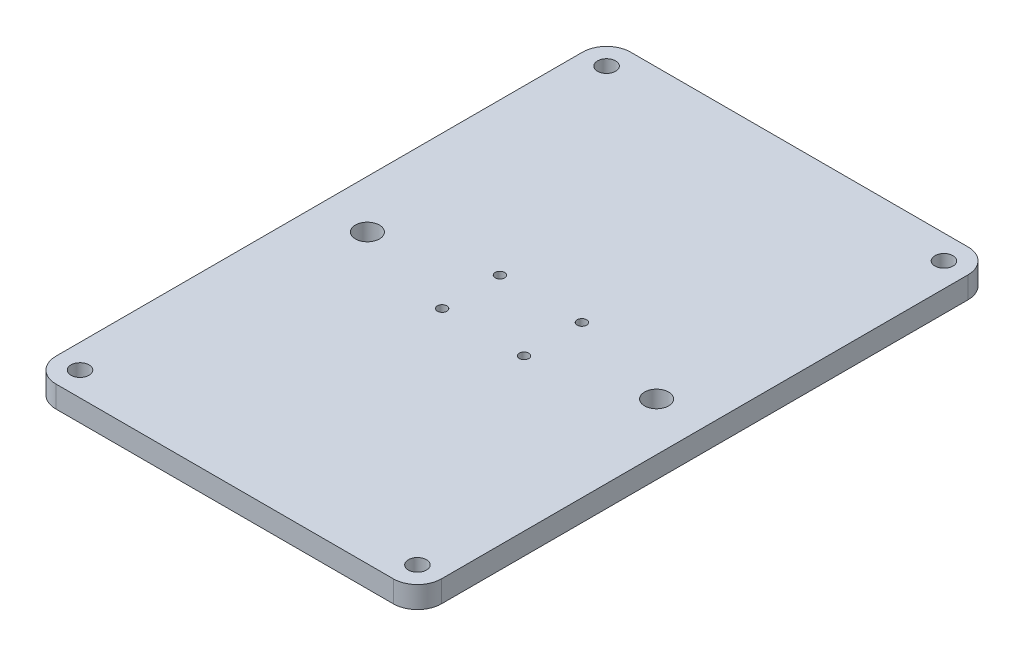
ISO-10303-21;
HEADER;
FILE_DESCRIPTION(('STEP AP214'),'2;1');
FILE_NAME('part.step','',(''),(''),'','','');
FILE_SCHEMA(('AUTOMOTIVE_DESIGN { 1 0 10303 214 1 1 1 1 }'));
ENDSEC;
DATA;
#1=APPLICATION_CONTEXT('core data for automotive mechanical design processes');
#2=APPLICATION_PROTOCOL_DEFINITION('international standard','automotive_design',2000,#1);
#3=PRODUCT_CONTEXT('',#1,'mechanical');
#4=PRODUCT('Part','Part','',(#3));
#5=PRODUCT_RELATED_PRODUCT_CATEGORY('part','',(#4));
#6=PRODUCT_DEFINITION_FORMATION('','',#4);
#7=PRODUCT_DEFINITION_CONTEXT('part definition',#1,'design');
#8=PRODUCT_DEFINITION('design','',#6,#7);
#9=PRODUCT_DEFINITION_SHAPE('','',#8);
#10=(LENGTH_UNIT() NAMED_UNIT(*) SI_UNIT(.MILLI.,.METRE.));
#11=(NAMED_UNIT(*) PLANE_ANGLE_UNIT() SI_UNIT($,.RADIAN.));
#12=(NAMED_UNIT(*) SI_UNIT($,.STERADIAN.) SOLID_ANGLE_UNIT());
#13=UNCERTAINTY_MEASURE_WITH_UNIT(LENGTH_MEASURE(1.E-05),#10,'distance_accuracy_value','');
#14=(GEOMETRIC_REPRESENTATION_CONTEXT(3) GLOBAL_UNCERTAINTY_ASSIGNED_CONTEXT((#13)) GLOBAL_UNIT_ASSIGNED_CONTEXT((#10,
#11,#12)) REPRESENTATION_CONTEXT('',''));
#15=CARTESIAN_POINT('',(0.,0.,0.));
#16=DIRECTION('',(0.,0.,1.));
#17=DIRECTION('',(1.,0.,0.));
#18=AXIS2_PLACEMENT_3D('',#15,#16,#17);
#19=CARTESIAN_POINT('',(44.45,-11.834974666687,69.3698729810778));
#20=DIRECTION('',(0.,1.,0.));
#21=DIRECTION('',(0.,0.,1.));
#22=AXIS2_PLACEMENT_3D('',#19,#20,#21);
#23=PLANE('',#22);
#24=CARTESIAN_POINT('',(-44.45,-11.834974666687,69.3698729810778));
#25=DIRECTION('',(0.,1.,0.));
#26=DIRECTION('',(0.,0.,1.));
#27=AXIS2_PLACEMENT_3D('',#24,#25,#26);
#28=CIRCLE('',#27,2.38125);
#29=CARTESIAN_POINT('',(-44.45,-11.834974666687,71.7511229810778));
#30=VERTEX_POINT('',#29);
#31=EDGE_CURVE('E224',#30,#30,#28,.T.);
#32=ORIENTED_EDGE('',*,*,#31,.F.);
#33=EDGE_LOOP('',(#32));
#34=FACE_BOUND('',#33,.T.);
#35=CARTESIAN_POINT('',(-44.45,-11.834974666687,-69.3698729810778));
#36=DIRECTION('',(0.,1.,0.));
#37=DIRECTION('',(0.,0.,1.));
#38=AXIS2_PLACEMENT_3D('',#35,#36,#37);
#39=CIRCLE('',#38,2.38125);
#40=CARTESIAN_POINT('',(-44.45,-11.834974666687,-66.9886229810778));
#41=VERTEX_POINT('',#40);
#42=EDGE_CURVE('E212',#41,#41,#39,.T.);
#43=ORIENTED_EDGE('',*,*,#42,.F.);
#44=EDGE_LOOP('',(#43));
#45=FACE_BOUND('',#44,.T.);
#46=CARTESIAN_POINT('',(38.1,-11.834974666687,0.));
#47=DIRECTION('',(0.,1.,0.));
#48=DIRECTION('',(0.,0.,1.));
#49=AXIS2_PLACEMENT_3D('',#46,#47,#48);
#50=CIRCLE('',#49,3.175);
#51=CARTESIAN_POINT('',(38.1,-11.834974666687,3.17499999999999));
#52=VERTEX_POINT('',#51);
#53=EDGE_CURVE('E200',#52,#52,#50,.T.);
#54=ORIENTED_EDGE('',*,*,#53,.F.);
#55=EDGE_LOOP('',(#54));
#56=FACE_BOUND('',#55,.T.);
#57=CARTESIAN_POINT('',(10.795,-11.834974666687,7.61999999999999));
#58=DIRECTION('',(0.,1.,0.));
#59=DIRECTION('',(0.,0.,1.));
#60=AXIS2_PLACEMENT_3D('',#57,#58,#59);
#61=CIRCLE('',#60,1.2500000000001);
#62=CARTESIAN_POINT('',(10.795,-11.834974666687,8.8700000000001));
#63=VERTEX_POINT('',#62);
#64=EDGE_CURVE('E188',#63,#63,#61,.T.);
#65=ORIENTED_EDGE('',*,*,#64,.F.);
#66=EDGE_LOOP('',(#65));
#67=FACE_BOUND('',#66,.T.);
#68=CARTESIAN_POINT('',(-10.795,-11.834974666687,-7.62000000000001));
#69=DIRECTION('',(0.,1.,0.));
#70=DIRECTION('',(0.,0.,1.));
#71=AXIS2_PLACEMENT_3D('',#68,#69,#70);
#72=CIRCLE('',#71,1.2500000000001);
#73=CARTESIAN_POINT('',(-10.795,-11.834974666687,-6.3699999999999));
#74=VERTEX_POINT('',#73);
#75=EDGE_CURVE('E134',#74,#74,#72,.T.);
#76=ORIENTED_EDGE('',*,*,#75,.F.);
#77=EDGE_LOOP('',(#76));
#78=FACE_BOUND('',#77,.T.);
#79=CARTESIAN_POINT('',(44.45,-11.834974666687,69.3698729810778));
#80=DIRECTION('',(0.,1.,0.));
#81=DIRECTION('',(0.,0.,1.));
#82=AXIS2_PLACEMENT_3D('',#79,#80,#81);
#83=CIRCLE('',#82,6.35);
#84=CARTESIAN_POINT('',(44.45,-11.834974666687,75.7198729810778));
#85=VERTEX_POINT('',#84);
#86=CARTESIAN_POINT('',(50.8,-11.834974666687,69.3698729810778));
#87=VERTEX_POINT('',#86);
#88=EDGE_CURVE('E145',#85,#87,#83,.T.);
#89=ORIENTED_EDGE('',*,*,#88,.T.);
#90=DIRECTION('',(0.,0.,-1.));
#91=VECTOR('',#90,1.);
#92=CARTESIAN_POINT('',(50.8,-11.834974666687,69.3698729810778));
#93=LINE('',#92,#91);
#94=CARTESIAN_POINT('',(50.8,-11.834974666687,-69.3698729810778));
#95=VERTEX_POINT('',#94);
#96=EDGE_CURVE('E93',#87,#95,#93,.T.);
#97=ORIENTED_EDGE('',*,*,#96,.T.);
#98=CARTESIAN_POINT('',(44.45,-11.834974666687,-69.3698729810778));
#99=DIRECTION('',(0.,1.,0.));
#100=DIRECTION('',(0.,0.,-1.));
#101=AXIS2_PLACEMENT_3D('',#98,#99,#100);
#102=CIRCLE('',#101,6.35);
#103=CARTESIAN_POINT('',(44.45,-11.834974666687,-75.7198729810778));
#104=VERTEX_POINT('',#103);
#105=EDGE_CURVE('E160',#95,#104,#102,.T.);
#106=ORIENTED_EDGE('',*,*,#105,.T.);
#107=DIRECTION('',(-1.,0.,0.));
#108=VECTOR('',#107,1.);
#109=CARTESIAN_POINT('',(-44.45,-11.834974666687,-75.7198729810778));
#110=LINE('',#109,#108);
#111=CARTESIAN_POINT('',(-44.45,-11.834974666687,-75.7198729810778));
#112=VERTEX_POINT('',#111);
#113=EDGE_CURVE('E173',#104,#112,#110,.T.);
#114=ORIENTED_EDGE('',*,*,#113,.T.);
#115=CARTESIAN_POINT('',(-44.45,-11.834974666687,-69.3698729810778));
#116=DIRECTION('',(0.,1.,0.));
#117=DIRECTION('',(0.,0.,-1.));
#118=AXIS2_PLACEMENT_3D('',#115,#116,#117);
#119=CIRCLE('',#118,6.35);
#120=CARTESIAN_POINT('',(-50.8,-11.834974666687,-69.3698729810778));
#121=VERTEX_POINT('',#120);
#122=EDGE_CURVE('E112',#112,#121,#119,.T.);
#123=ORIENTED_EDGE('',*,*,#122,.T.);
#124=DIRECTION('',(0.,0.,1.));
#125=VECTOR('',#124,1.);
#126=CARTESIAN_POINT('',(-50.8,-11.834974666687,69.3698729810778));
#127=LINE('',#126,#125);
#128=CARTESIAN_POINT('',(-50.8,-11.834974666687,69.3698729810778));
#129=VERTEX_POINT('',#128);
#130=EDGE_CURVE('E106',#121,#129,#127,.T.);
#131=ORIENTED_EDGE('',*,*,#130,.T.);
#132=CARTESIAN_POINT('',(-44.45,-11.834974666687,69.3698729810778));
#133=DIRECTION('',(0.,1.,0.));
#134=DIRECTION('',(0.,0.,-1.));
#135=AXIS2_PLACEMENT_3D('',#132,#133,#134);
#136=CIRCLE('',#135,6.35);
#137=CARTESIAN_POINT('',(-44.45,-11.834974666687,75.7198729810778));
#138=VERTEX_POINT('',#137);
#139=EDGE_CURVE('E110',#129,#138,#136,.T.);
#140=ORIENTED_EDGE('',*,*,#139,.T.);
#141=DIRECTION('',(1.,0.,0.));
#142=VECTOR('',#141,1.);
#143=CARTESIAN_POINT('',(-44.45,-11.834974666687,75.7198729810778));
#144=LINE('',#143,#142);
#145=EDGE_CURVE('E50',#138,#85,#144,.T.);
#146=ORIENTED_EDGE('',*,*,#145,.T.);
#147=EDGE_LOOP('',(#89,#97,#106,#114,#123,#131,#140,#146));
#148=FACE_BOUND('',#147,.T.);
#149=CARTESIAN_POINT('',(-10.795,-11.834974666687,7.62));
#150=DIRECTION('',(0.,1.,0.));
#151=DIRECTION('',(0.,0.,1.));
#152=AXIS2_PLACEMENT_3D('',#149,#150,#151);
#153=CIRCLE('',#152,1.2500000000001);
#154=CARTESIAN_POINT('',(-10.795,-11.834974666687,8.8700000000001));
#155=VERTEX_POINT('',#154);
#156=EDGE_CURVE('E182',#155,#155,#153,.T.);
#157=ORIENTED_EDGE('',*,*,#156,.F.);
#158=EDGE_LOOP('',(#157));
#159=FACE_BOUND('',#158,.T.);
#160=CARTESIAN_POINT('',(10.795,-11.834974666687,-7.62000000000001));
#161=DIRECTION('',(0.,1.,0.));
#162=DIRECTION('',(0.,0.,1.));
#163=AXIS2_PLACEMENT_3D('',#160,#161,#162);
#164=CIRCLE('',#163,1.2500000000001);
#165=CARTESIAN_POINT('',(10.795,-11.834974666687,-6.36999999999991));
#166=VERTEX_POINT('',#165);
#167=EDGE_CURVE('E194',#166,#166,#164,.T.);
#168=ORIENTED_EDGE('',*,*,#167,.F.);
#169=EDGE_LOOP('',(#168));
#170=FACE_BOUND('',#169,.T.);
#171=CARTESIAN_POINT('',(-38.1,-11.834974666687,0.));
#172=DIRECTION('',(0.,1.,0.));
#173=DIRECTION('',(0.,0.,1.));
#174=AXIS2_PLACEMENT_3D('',#171,#172,#173);
#175=CIRCLE('',#174,3.175);
#176=CARTESIAN_POINT('',(-38.1,-11.834974666687,3.17499999999999));
#177=VERTEX_POINT('',#176);
#178=EDGE_CURVE('E206',#177,#177,#175,.T.);
#179=ORIENTED_EDGE('',*,*,#178,.F.);
#180=EDGE_LOOP('',(#179));
#181=FACE_BOUND('',#180,.T.);
#182=CARTESIAN_POINT('',(44.45,-11.834974666687,-69.3698729810778));
#183=DIRECTION('',(0.,1.,0.));
#184=DIRECTION('',(0.,0.,1.));
#185=AXIS2_PLACEMENT_3D('',#182,#183,#184);
#186=CIRCLE('',#185,2.38125);
#187=CARTESIAN_POINT('',(44.45,-11.834974666687,-66.9886229810778));
#188=VERTEX_POINT('',#187);
#189=EDGE_CURVE('E218',#188,#188,#186,.T.);
#190=ORIENTED_EDGE('',*,*,#189,.F.);
#191=EDGE_LOOP('',(#190));
#192=FACE_BOUND('',#191,.T.);
#193=CARTESIAN_POINT('',(44.45,-11.834974666687,69.3698729810778));
#194=DIRECTION('',(0.,1.,0.));
#195=DIRECTION('',(0.,0.,1.));
#196=AXIS2_PLACEMENT_3D('',#193,#194,#195);
#197=CIRCLE('',#196,2.38125);
#198=CARTESIAN_POINT('',(44.45,-11.834974666687,71.7511229810778));
#199=VERTEX_POINT('',#198);
#200=EDGE_CURVE('E230',#199,#199,#197,.T.);
#201=ORIENTED_EDGE('',*,*,#200,.F.);
#202=EDGE_LOOP('',(#201));
#203=FACE_BOUND('',#202,.T.);
#204=ADVANCED_FACE('F33',(#34,#45,#56,#67,#78,#148,#159,#170,#181,#192,#203),#23,.T.);
#205=CARTESIAN_POINT('',(44.45,-17.549974666687,69.3698729810778));
#206=DIRECTION('',(0.,1.,0.));
#207=DIRECTION('',(0.,0.,1.));
#208=AXIS2_PLACEMENT_3D('',#205,#206,#207);
#209=PLANE('',#208);
#210=CARTESIAN_POINT('',(44.45,-17.549974666687,69.3698729810778));
#211=DIRECTION('',(0.,1.,0.));
#212=DIRECTION('',(0.,0.,1.));
#213=AXIS2_PLACEMENT_3D('',#210,#211,#212);
#214=CIRCLE('',#213,6.35);
#215=CARTESIAN_POINT('',(44.45,-17.549974666687,75.7198729810778));
#216=VERTEX_POINT('',#215);
#217=CARTESIAN_POINT('',(50.8,-17.549974666687,69.3698729810778));
#218=VERTEX_POINT('',#217);
#219=EDGE_CURVE('E130',#216,#218,#214,.T.);
#220=ORIENTED_EDGE('',*,*,#219,.F.);
#221=DIRECTION('',(1.,0.,0.));
#222=VECTOR('',#221,1.);
#223=CARTESIAN_POINT('',(-44.45,-17.549974666687,75.7198729810778));
#224=LINE('',#223,#222);
#225=CARTESIAN_POINT('',(-44.45,-17.549974666687,75.7198729810778));
#226=VERTEX_POINT('',#225);
#227=EDGE_CURVE('E85',#226,#216,#224,.T.);
#228=ORIENTED_EDGE('',*,*,#227,.F.);
#229=CARTESIAN_POINT('',(-44.45,-17.549974666687,69.3698729810778));
#230=DIRECTION('',(0.,1.,0.));
#231=DIRECTION('',(0.,0.,-1.));
#232=AXIS2_PLACEMENT_3D('',#229,#230,#231);
#233=CIRCLE('',#232,6.35);
#234=CARTESIAN_POINT('',(-50.8,-17.549974666687,69.3698729810778));
#235=VERTEX_POINT('',#234);
#236=EDGE_CURVE('E79',#235,#226,#233,.T.);
#237=ORIENTED_EDGE('',*,*,#236,.F.);
#238=DIRECTION('',(0.,0.,1.));
#239=VECTOR('',#238,1.);
#240=CARTESIAN_POINT('',(-50.8,-17.549974666687,69.3698729810778));
#241=LINE('',#240,#239);
#242=CARTESIAN_POINT('',(-50.8,-17.549974666687,-69.3698729810778));
#243=VERTEX_POINT('',#242);
#244=EDGE_CURVE('E120',#243,#235,#241,.T.);
#245=ORIENTED_EDGE('',*,*,#244,.F.);
#246=CARTESIAN_POINT('',(-44.45,-17.549974666687,-69.3698729810778));
#247=DIRECTION('',(0.,1.,0.));
#248=DIRECTION('',(0.,0.,-1.));
#249=AXIS2_PLACEMENT_3D('',#246,#247,#248);
#250=CIRCLE('',#249,6.35);
#251=CARTESIAN_POINT('',(-44.45,-17.549974666687,-75.7198729810778));
#252=VERTEX_POINT('',#251);
#253=EDGE_CURVE('E140',#252,#243,#250,.T.);
#254=ORIENTED_EDGE('',*,*,#253,.F.);
#255=DIRECTION('',(-1.,0.,0.));
#256=VECTOR('',#255,1.);
#257=CARTESIAN_POINT('',(-44.45,-17.549974666687,-75.7198729810778));
#258=LINE('',#257,#256);
#259=CARTESIAN_POINT('',(44.45,-17.549974666687,-75.7198729810778));
#260=VERTEX_POINT('',#259);
#261=EDGE_CURVE('E138',#260,#252,#258,.T.);
#262=ORIENTED_EDGE('',*,*,#261,.F.);
#263=CARTESIAN_POINT('',(44.45,-17.549974666687,-69.3698729810778));
#264=DIRECTION('',(0.,1.,0.));
#265=DIRECTION('',(0.,0.,-1.));
#266=AXIS2_PLACEMENT_3D('',#263,#264,#265);
#267=CIRCLE('',#266,6.35);
#268=CARTESIAN_POINT('',(50.8,-17.549974666687,-69.3698729810778));
#269=VERTEX_POINT('',#268);
#270=EDGE_CURVE('E136',#269,#260,#267,.T.);
#271=ORIENTED_EDGE('',*,*,#270,.F.);
#272=DIRECTION('',(0.,0.,-1.));
#273=VECTOR('',#272,1.);
#274=CARTESIAN_POINT('',(50.8,-17.549974666687,69.3698729810778));
#275=LINE('',#274,#273);
#276=EDGE_CURVE('E133',#218,#269,#275,.T.);
#277=ORIENTED_EDGE('',*,*,#276,.F.);
#278=EDGE_LOOP('',(#220,#228,#237,#245,#254,#262,#271,#277));
#279=FACE_BOUND('',#278,.T.);
#280=CARTESIAN_POINT('',(-10.795,-17.549974666687,-7.62000000000001));
#281=DIRECTION('',(0.,1.,0.));
#282=DIRECTION('',(0.,0.,1.));
#283=AXIS2_PLACEMENT_3D('',#280,#281,#282);
#284=CIRCLE('',#283,1.2500000000001);
#285=CARTESIAN_POINT('',(-10.795,-17.549974666687,-6.3699999999999));
#286=VERTEX_POINT('',#285);
#287=EDGE_CURVE('E179',#286,#286,#284,.T.);
#288=ORIENTED_EDGE('',*,*,#287,.T.);
#289=EDGE_LOOP('',(#288));
#290=FACE_BOUND('',#289,.T.);
#291=CARTESIAN_POINT('',(-10.795,-17.549974666687,7.62));
#292=DIRECTION('',(0.,1.,0.));
#293=DIRECTION('',(0.,0.,1.));
#294=AXIS2_PLACEMENT_3D('',#291,#292,#293);
#295=CIRCLE('',#294,1.2500000000001);
#296=CARTESIAN_POINT('',(-10.795,-17.549974666687,8.8700000000001));
#297=VERTEX_POINT('',#296);
#298=EDGE_CURVE('E185',#297,#297,#295,.T.);
#299=ORIENTED_EDGE('',*,*,#298,.T.);
#300=EDGE_LOOP('',(#299));
#301=FACE_BOUND('',#300,.T.);
#302=CARTESIAN_POINT('',(10.795,-17.549974666687,7.61999999999999));
#303=DIRECTION('',(0.,1.,0.));
#304=DIRECTION('',(0.,0.,1.));
#305=AXIS2_PLACEMENT_3D('',#302,#303,#304);
#306=CIRCLE('',#305,1.2500000000001);
#307=CARTESIAN_POINT('',(10.795,-17.549974666687,8.8700000000001));
#308=VERTEX_POINT('',#307);
#309=EDGE_CURVE('E191',#308,#308,#306,.T.);
#310=ORIENTED_EDGE('',*,*,#309,.T.);
#311=EDGE_LOOP('',(#310));
#312=FACE_BOUND('',#311,.T.);
#313=CARTESIAN_POINT('',(10.795,-17.549974666687,-7.62000000000001));
#314=DIRECTION('',(0.,1.,0.));
#315=DIRECTION('',(0.,0.,1.));
#316=AXIS2_PLACEMENT_3D('',#313,#314,#315);
#317=CIRCLE('',#316,1.2500000000001);
#318=CARTESIAN_POINT('',(10.795,-17.549974666687,-6.36999999999991));
#319=VERTEX_POINT('',#318);
#320=EDGE_CURVE('E197',#319,#319,#317,.T.);
#321=ORIENTED_EDGE('',*,*,#320,.T.);
#322=EDGE_LOOP('',(#321));
#323=FACE_BOUND('',#322,.T.);
#324=CARTESIAN_POINT('',(38.1,-17.549974666687,0.));
#325=DIRECTION('',(0.,1.,0.));
#326=DIRECTION('',(0.,0.,1.));
#327=AXIS2_PLACEMENT_3D('',#324,#325,#326);
#328=CIRCLE('',#327,3.175);
#329=CARTESIAN_POINT('',(38.1,-17.549974666687,3.17499999999999));
#330=VERTEX_POINT('',#329);
#331=EDGE_CURVE('E203',#330,#330,#328,.T.);
#332=ORIENTED_EDGE('',*,*,#331,.T.);
#333=EDGE_LOOP('',(#332));
#334=FACE_BOUND('',#333,.T.);
#335=CARTESIAN_POINT('',(-38.1,-17.549974666687,0.));
#336=DIRECTION('',(0.,1.,0.));
#337=DIRECTION('',(0.,0.,1.));
#338=AXIS2_PLACEMENT_3D('',#335,#336,#337);
#339=CIRCLE('',#338,3.175);
#340=CARTESIAN_POINT('',(-38.1,-17.549974666687,3.17499999999999));
#341=VERTEX_POINT('',#340);
#342=EDGE_CURVE('E209',#341,#341,#339,.T.);
#343=ORIENTED_EDGE('',*,*,#342,.T.);
#344=EDGE_LOOP('',(#343));
#345=FACE_BOUND('',#344,.T.);
#346=CARTESIAN_POINT('',(-44.45,-17.549974666687,-69.3698729810778));
#347=DIRECTION('',(0.,1.,0.));
#348=DIRECTION('',(0.,0.,1.));
#349=AXIS2_PLACEMENT_3D('',#346,#347,#348);
#350=CIRCLE('',#349,2.38125);
#351=CARTESIAN_POINT('',(-44.45,-17.549974666687,-66.9886229810778));
#352=VERTEX_POINT('',#351);
#353=EDGE_CURVE('E215',#352,#352,#350,.T.);
#354=ORIENTED_EDGE('',*,*,#353,.T.);
#355=EDGE_LOOP('',(#354));
#356=FACE_BOUND('',#355,.T.);
#357=CARTESIAN_POINT('',(44.45,-17.549974666687,-69.3698729810778));
#358=DIRECTION('',(0.,1.,0.));
#359=DIRECTION('',(0.,0.,1.));
#360=AXIS2_PLACEMENT_3D('',#357,#358,#359);
#361=CIRCLE('',#360,2.38125);
#362=CARTESIAN_POINT('',(44.45,-17.549974666687,-66.9886229810778));
#363=VERTEX_POINT('',#362);
#364=EDGE_CURVE('E221',#363,#363,#361,.T.);
#365=ORIENTED_EDGE('',*,*,#364,.T.);
#366=EDGE_LOOP('',(#365));
#367=FACE_BOUND('',#366,.T.);
#368=CARTESIAN_POINT('',(-44.45,-17.549974666687,69.3698729810778));
#369=DIRECTION('',(0.,1.,0.));
#370=DIRECTION('',(0.,0.,1.));
#371=AXIS2_PLACEMENT_3D('',#368,#369,#370);
#372=CIRCLE('',#371,2.38125);
#373=CARTESIAN_POINT('',(-44.45,-17.549974666687,71.7511229810778));
#374=VERTEX_POINT('',#373);
#375=EDGE_CURVE('E227',#374,#374,#372,.T.);
#376=ORIENTED_EDGE('',*,*,#375,.T.);
#377=EDGE_LOOP('',(#376));
#378=FACE_BOUND('',#377,.T.);
#379=CARTESIAN_POINT('',(44.45,-17.549974666687,69.3698729810778));
#380=DIRECTION('',(0.,1.,0.));
#381=DIRECTION('',(0.,0.,1.));
#382=AXIS2_PLACEMENT_3D('',#379,#380,#381);
#383=CIRCLE('',#382,2.38125);
#384=CARTESIAN_POINT('',(44.45,-17.549974666687,71.7511229810778));
#385=VERTEX_POINT('',#384);
#386=EDGE_CURVE('E233',#385,#385,#383,.T.);
#387=ORIENTED_EDGE('',*,*,#386,.T.);
#388=EDGE_LOOP('',(#387));
#389=FACE_BOUND('',#388,.T.);
#390=ADVANCED_FACE('F164',(#279,#290,#301,#312,#323,#334,#345,#356,#367,#378,#389),#209,.F.);
#391=CARTESIAN_POINT('',(44.45,-11.834974666687,69.3698729810778));
#392=DIRECTION('',(0.,-1.,0.));
#393=DIRECTION('',(0.,0.,-1.));
#394=AXIS2_PLACEMENT_3D('',#391,#392,#393);
#395=CYLINDRICAL_SURFACE('',#394,6.35);
#396=ORIENTED_EDGE('',*,*,#219,.T.);
#397=DIRECTION('',(0.,-1.,0.));
#398=VECTOR('',#397,1.);
#399=CARTESIAN_POINT('',(50.8,-11.834974666687,69.3698729810778));
#400=LINE('',#399,#398);
#401=EDGE_CURVE('E11',#87,#218,#400,.T.);
#402=ORIENTED_EDGE('',*,*,#401,.F.);
#403=ORIENTED_EDGE('',*,*,#88,.F.);
#404=DIRECTION('',(0.,-1.,0.));
#405=VECTOR('',#404,1.);
#406=CARTESIAN_POINT('',(44.45,-11.834974666687,75.7198729810778));
#407=LINE('',#406,#405);
#408=EDGE_CURVE('E126',#85,#216,#407,.T.);
#409=ORIENTED_EDGE('',*,*,#408,.T.);
#410=EDGE_LOOP('',(#396,#402,#403,#409));
#411=FACE_BOUND('',#410,.T.);
#412=ADVANCED_FACE('F35',(#411),#395,.T.);
#413=CARTESIAN_POINT('',(50.8,-11.834974666687,69.3698729810778));
#414=DIRECTION('',(-1.,0.,0.));
#415=DIRECTION('',(0.,0.,1.));
#416=AXIS2_PLACEMENT_3D('',#413,#414,#415);
#417=PLANE('',#416);
#418=ORIENTED_EDGE('',*,*,#276,.T.);
#419=DIRECTION('',(0.,-1.,0.));
#420=VECTOR('',#419,1.);
#421=CARTESIAN_POINT('',(50.8,-11.834974666687,-69.3698729810778));
#422=LINE('',#421,#420);
#423=EDGE_CURVE('E42',#95,#269,#422,.T.);
#424=ORIENTED_EDGE('',*,*,#423,.F.);
#425=ORIENTED_EDGE('',*,*,#96,.F.);
#426=ORIENTED_EDGE('',*,*,#401,.T.);
#427=EDGE_LOOP('',(#418,#424,#425,#426));
#428=FACE_BOUND('',#427,.T.);
#429=ADVANCED_FACE('F267',(#428),#417,.F.);
#430=CARTESIAN_POINT('',(44.45,-11.834974666687,-69.3698729810778));
#431=DIRECTION('',(0.,-1.,0.));
#432=DIRECTION('',(0.,0.,-1.));
#433=AXIS2_PLACEMENT_3D('',#430,#431,#432);
#434=CYLINDRICAL_SURFACE('',#433,6.35);
#435=ORIENTED_EDGE('',*,*,#270,.T.);
#436=DIRECTION('',(0.,-1.,0.));
#437=VECTOR('',#436,1.);
#438=CARTESIAN_POINT('',(44.45,-11.834974666687,-75.7198729810778));
#439=LINE('',#438,#437);
#440=EDGE_CURVE('E152',#104,#260,#439,.T.);
#441=ORIENTED_EDGE('',*,*,#440,.F.);
#442=ORIENTED_EDGE('',*,*,#105,.F.);
#443=ORIENTED_EDGE('',*,*,#423,.T.);
#444=EDGE_LOOP('',(#435,#441,#442,#443));
#445=FACE_BOUND('',#444,.T.);
#446=ADVANCED_FACE('F158',(#445),#434,.T.);
#447=CARTESIAN_POINT('',(-44.45,-11.834974666687,-75.7198729810778));
#448=DIRECTION('',(0.,0.,1.));
#449=DIRECTION('',(1.,0.,0.));
#450=AXIS2_PLACEMENT_3D('',#447,#448,#449);
#451=PLANE('',#450);
#452=ORIENTED_EDGE('',*,*,#261,.T.);
#453=DIRECTION('',(0.,-1.,0.));
#454=VECTOR('',#453,1.);
#455=CARTESIAN_POINT('',(-44.45,-11.834974666687,-75.7198729810778));
#456=LINE('',#455,#454);
#457=EDGE_CURVE('E149',#112,#252,#456,.T.);
#458=ORIENTED_EDGE('',*,*,#457,.F.);
#459=ORIENTED_EDGE('',*,*,#113,.F.);
#460=ORIENTED_EDGE('',*,*,#440,.T.);
#461=EDGE_LOOP('',(#452,#458,#459,#460));
#462=FACE_BOUND('',#461,.T.);
#463=ADVANCED_FACE('F169',(#462),#451,.F.);
#464=CARTESIAN_POINT('',(-44.45,-11.834974666687,-69.3698729810778));
#465=DIRECTION('',(0.,-1.,0.));
#466=DIRECTION('',(0.,0.,-1.));
#467=AXIS2_PLACEMENT_3D('',#464,#465,#466);
#468=CYLINDRICAL_SURFACE('',#467,6.35);
#469=ORIENTED_EDGE('',*,*,#253,.T.);
#470=DIRECTION('',(0.,-1.,0.));
#471=VECTOR('',#470,1.);
#472=CARTESIAN_POINT('',(-50.8,-11.834974666687,-69.3698729810778));
#473=LINE('',#472,#471);
#474=EDGE_CURVE('E121',#121,#243,#473,.T.);
#475=ORIENTED_EDGE('',*,*,#474,.F.);
#476=ORIENTED_EDGE('',*,*,#122,.F.);
#477=ORIENTED_EDGE('',*,*,#457,.T.);
#478=EDGE_LOOP('',(#469,#475,#476,#477));
#479=FACE_BOUND('',#478,.T.);
#480=ADVANCED_FACE('F172',(#479),#468,.T.);
#481=CARTESIAN_POINT('',(-50.8,-11.834974666687,69.3698729810778));
#482=DIRECTION('',(1.,0.,0.));
#483=DIRECTION('',(0.,0.,-1.));
#484=AXIS2_PLACEMENT_3D('',#481,#482,#483);
#485=PLANE('',#484);
#486=ORIENTED_EDGE('',*,*,#244,.T.);
#487=DIRECTION('',(0.,-1.,0.));
#488=VECTOR('',#487,1.);
#489=CARTESIAN_POINT('',(-50.8,-11.834974666687,69.3698729810778));
#490=LINE('',#489,#488);
#491=EDGE_CURVE('E117',#129,#235,#490,.T.);
#492=ORIENTED_EDGE('',*,*,#491,.F.);
#493=ORIENTED_EDGE('',*,*,#130,.F.);
#494=ORIENTED_EDGE('',*,*,#474,.T.);
#495=EDGE_LOOP('',(#486,#492,#493,#494));
#496=FACE_BOUND('',#495,.T.);
#497=ADVANCED_FACE('F118',(#496),#485,.F.);
#498=CARTESIAN_POINT('',(-44.45,-11.834974666687,69.3698729810778));
#499=DIRECTION('',(0.,-1.,0.));
#500=DIRECTION('',(0.,0.,-1.));
#501=AXIS2_PLACEMENT_3D('',#498,#499,#500);
#502=CYLINDRICAL_SURFACE('',#501,6.35);
#503=ORIENTED_EDGE('',*,*,#236,.T.);
#504=DIRECTION('',(0.,-1.,0.));
#505=VECTOR('',#504,1.);
#506=CARTESIAN_POINT('',(-44.45,-11.834974666687,75.7198729810778));
#507=LINE('',#506,#505);
#508=EDGE_CURVE('E122',#138,#226,#507,.T.);
#509=ORIENTED_EDGE('',*,*,#508,.F.);
#510=ORIENTED_EDGE('',*,*,#139,.F.);
#511=ORIENTED_EDGE('',*,*,#491,.T.);
#512=EDGE_LOOP('',(#503,#509,#510,#511));
#513=FACE_BOUND('',#512,.T.);
#514=ADVANCED_FACE('F124',(#513),#502,.T.);
#515=CARTESIAN_POINT('',(-44.45,-11.834974666687,75.7198729810778));
#516=DIRECTION('',(0.,0.,-1.));
#517=DIRECTION('',(-1.,0.,0.));
#518=AXIS2_PLACEMENT_3D('',#515,#516,#517);
#519=PLANE('',#518);
#520=ORIENTED_EDGE('',*,*,#227,.T.);
#521=ORIENTED_EDGE('',*,*,#408,.F.);
#522=ORIENTED_EDGE('',*,*,#145,.F.);
#523=ORIENTED_EDGE('',*,*,#508,.T.);
#524=EDGE_LOOP('',(#520,#521,#522,#523));
#525=FACE_BOUND('',#524,.T.);
#526=ADVANCED_FACE('F255',(#525),#519,.F.);
#527=CARTESIAN_POINT('',(-10.795,-11.834974666687,-7.62000000000001));
#528=DIRECTION('',(0.,-1.,0.));
#529=DIRECTION('',(0.,0.,-1.));
#530=AXIS2_PLACEMENT_3D('',#527,#528,#529);
#531=CYLINDRICAL_SURFACE('',#530,1.2500000000001);
#532=ORIENTED_EDGE('',*,*,#75,.T.);
#533=EDGE_LOOP('',(#532));
#534=FACE_BOUND('',#533,.T.);
#535=ORIENTED_EDGE('',*,*,#287,.F.);
#536=EDGE_LOOP('',(#535));
#537=FACE_BOUND('',#536,.T.);
#538=ADVANCED_FACE('F252',(#534,#537),#531,.F.);
#539=CARTESIAN_POINT('',(-10.795,-11.834974666687,7.62));
#540=DIRECTION('',(0.,-1.,0.));
#541=DIRECTION('',(0.,0.,-1.));
#542=AXIS2_PLACEMENT_3D('',#539,#540,#541);
#543=CYLINDRICAL_SURFACE('',#542,1.2500000000001);
#544=ORIENTED_EDGE('',*,*,#156,.T.);
#545=EDGE_LOOP('',(#544));
#546=FACE_BOUND('',#545,.T.);
#547=ORIENTED_EDGE('',*,*,#298,.F.);
#548=EDGE_LOOP('',(#547));
#549=FACE_BOUND('',#548,.T.);
#550=ADVANCED_FACE('F331',(#546,#549),#543,.F.);
#551=CARTESIAN_POINT('',(10.795,-11.834974666687,7.61999999999999));
#552=DIRECTION('',(0.,-1.,0.));
#553=DIRECTION('',(0.,0.,-1.));
#554=AXIS2_PLACEMENT_3D('',#551,#552,#553);
#555=CYLINDRICAL_SURFACE('',#554,1.2500000000001);
#556=ORIENTED_EDGE('',*,*,#64,.T.);
#557=EDGE_LOOP('',(#556));
#558=FACE_BOUND('',#557,.T.);
#559=ORIENTED_EDGE('',*,*,#309,.F.);
#560=EDGE_LOOP('',(#559));
#561=FACE_BOUND('',#560,.T.);
#562=ADVANCED_FACE('F339',(#558,#561),#555,.F.);
#563=CARTESIAN_POINT('',(10.795,-11.834974666687,-7.62000000000001));
#564=DIRECTION('',(0.,-1.,0.));
#565=DIRECTION('',(0.,0.,-1.));
#566=AXIS2_PLACEMENT_3D('',#563,#564,#565);
#567=CYLINDRICAL_SURFACE('',#566,1.2500000000001);
#568=ORIENTED_EDGE('',*,*,#167,.T.);
#569=EDGE_LOOP('',(#568));
#570=FACE_BOUND('',#569,.T.);
#571=ORIENTED_EDGE('',*,*,#320,.F.);
#572=EDGE_LOOP('',(#571));
#573=FACE_BOUND('',#572,.T.);
#574=ADVANCED_FACE('F347',(#570,#573),#567,.F.);
#575=CARTESIAN_POINT('',(38.1,-11.834974666687,0.));
#576=DIRECTION('',(0.,-1.,0.));
#577=DIRECTION('',(0.,0.,-1.));
#578=AXIS2_PLACEMENT_3D('',#575,#576,#577);
#579=CYLINDRICAL_SURFACE('',#578,3.175);
#580=ORIENTED_EDGE('',*,*,#53,.T.);
#581=EDGE_LOOP('',(#580));
#582=FACE_BOUND('',#581,.T.);
#583=ORIENTED_EDGE('',*,*,#331,.F.);
#584=EDGE_LOOP('',(#583));
#585=FACE_BOUND('',#584,.T.);
#586=ADVANCED_FACE('F356',(#582,#585),#579,.F.);
#587=CARTESIAN_POINT('',(-38.1,-11.834974666687,0.));
#588=DIRECTION('',(0.,-1.,0.));
#589=DIRECTION('',(0.,0.,-1.));
#590=AXIS2_PLACEMENT_3D('',#587,#588,#589);
#591=CYLINDRICAL_SURFACE('',#590,3.175);
#592=ORIENTED_EDGE('',*,*,#178,.T.);
#593=EDGE_LOOP('',(#592));
#594=FACE_BOUND('',#593,.T.);
#595=ORIENTED_EDGE('',*,*,#342,.F.);
#596=EDGE_LOOP('',(#595));
#597=FACE_BOUND('',#596,.T.);
#598=ADVANCED_FACE('F365',(#594,#597),#591,.F.);
#599=CARTESIAN_POINT('',(-44.45,-11.834974666687,-69.3698729810778));
#600=DIRECTION('',(0.,-1.,0.));
#601=DIRECTION('',(0.,0.,-1.));
#602=AXIS2_PLACEMENT_3D('',#599,#600,#601);
#603=CYLINDRICAL_SURFACE('',#602,2.38125);
#604=ORIENTED_EDGE('',*,*,#42,.T.);
#605=EDGE_LOOP('',(#604));
#606=FACE_BOUND('',#605,.T.);
#607=ORIENTED_EDGE('',*,*,#353,.F.);
#608=EDGE_LOOP('',(#607));
#609=FACE_BOUND('',#608,.T.);
#610=ADVANCED_FACE('F374',(#606,#609),#603,.F.);
#611=CARTESIAN_POINT('',(44.45,-11.834974666687,-69.3698729810778));
#612=DIRECTION('',(0.,-1.,0.));
#613=DIRECTION('',(0.,0.,-1.));
#614=AXIS2_PLACEMENT_3D('',#611,#612,#613);
#615=CYLINDRICAL_SURFACE('',#614,2.38125);
#616=ORIENTED_EDGE('',*,*,#189,.T.);
#617=EDGE_LOOP('',(#616));
#618=FACE_BOUND('',#617,.T.);
#619=ORIENTED_EDGE('',*,*,#364,.F.);
#620=EDGE_LOOP('',(#619));
#621=FACE_BOUND('',#620,.T.);
#622=ADVANCED_FACE('F383',(#618,#621),#615,.F.);
#623=CARTESIAN_POINT('',(-44.45,-11.834974666687,69.3698729810778));
#624=DIRECTION('',(0.,-1.,0.));
#625=DIRECTION('',(0.,0.,-1.));
#626=AXIS2_PLACEMENT_3D('',#623,#624,#625);
#627=CYLINDRICAL_SURFACE('',#626,2.38125);
#628=ORIENTED_EDGE('',*,*,#31,.T.);
#629=EDGE_LOOP('',(#628));
#630=FACE_BOUND('',#629,.T.);
#631=ORIENTED_EDGE('',*,*,#375,.F.);
#632=EDGE_LOOP('',(#631));
#633=FACE_BOUND('',#632,.T.);
#634=ADVANCED_FACE('F392',(#630,#633),#627,.F.);
#635=CARTESIAN_POINT('',(44.45,-11.834974666687,69.3698729810778));
#636=DIRECTION('',(0.,-1.,0.));
#637=DIRECTION('',(0.,0.,-1.));
#638=AXIS2_PLACEMENT_3D('',#635,#636,#637);
#639=CYLINDRICAL_SURFACE('',#638,2.38125);
#640=ORIENTED_EDGE('',*,*,#200,.T.);
#641=EDGE_LOOP('',(#640));
#642=FACE_BOUND('',#641,.T.);
#643=ORIENTED_EDGE('',*,*,#386,.F.);
#644=EDGE_LOOP('',(#643));
#645=FACE_BOUND('',#644,.T.);
#646=ADVANCED_FACE('F239',(#642,#645),#639,.F.);
#647=CLOSED_SHELL('',(#204,#390,#412,#429,#446,#463,#480,#497,#514,#526,#538,#550,#562,#574,
#586,#598,#610,#622,#634,#646));
#648=MANIFOLD_SOLID_BREP('B2',#647);
#649=ADVANCED_BREP_SHAPE_REPRESENTATION('',(#18,#648),#14);
#650=SHAPE_DEFINITION_REPRESENTATION(#9,#649);
ENDSEC;
END-ISO-10303-21;
